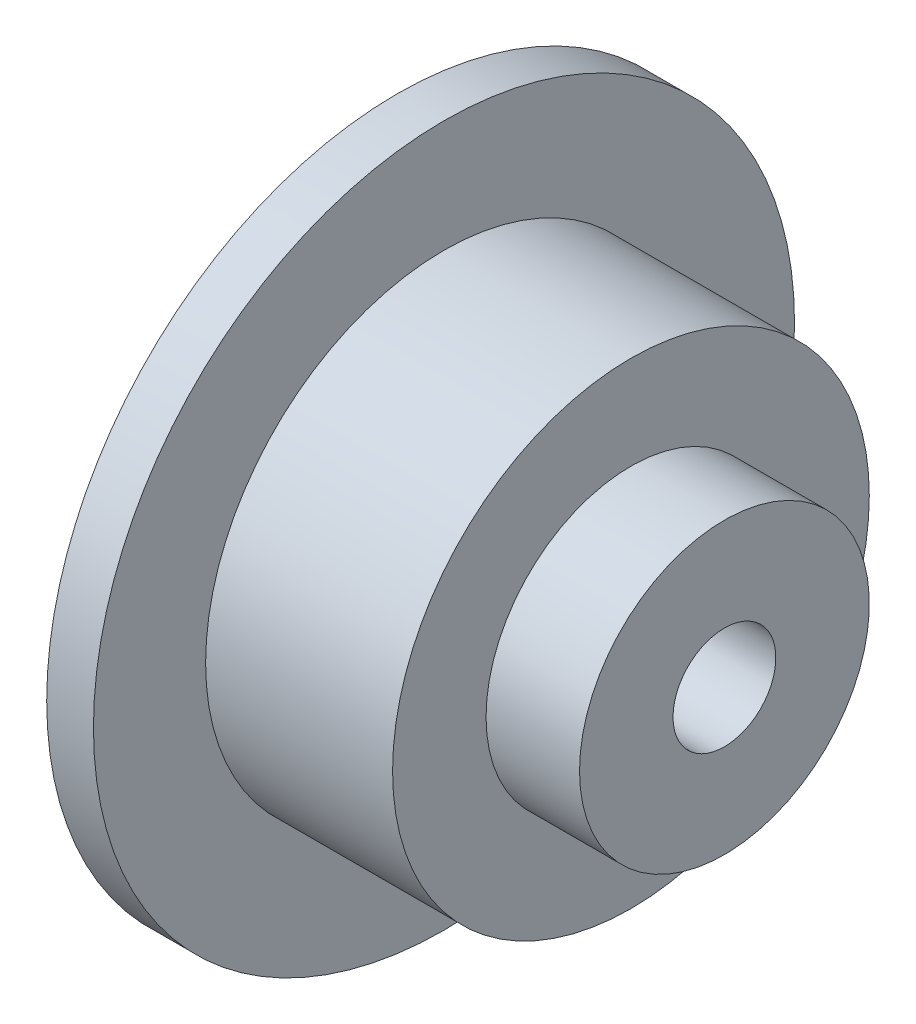
ISO-10303-21;
HEADER;
FILE_DESCRIPTION(('STEP AP214'),'2;1');
FILE_NAME('part.step','',(''),(''),'','','');
FILE_SCHEMA(('AUTOMOTIVE_DESIGN { 1 0 10303 214 1 1 1 1 }'));
ENDSEC;
DATA;
#1=APPLICATION_CONTEXT('core data for automotive mechanical design processes');
#2=APPLICATION_PROTOCOL_DEFINITION('international standard','automotive_design',2000,#1);
#3=PRODUCT_CONTEXT('',#1,'mechanical');
#4=PRODUCT('Part','Part','',(#3));
#5=PRODUCT_RELATED_PRODUCT_CATEGORY('part','',(#4));
#6=PRODUCT_DEFINITION_FORMATION('','',#4);
#7=PRODUCT_DEFINITION_CONTEXT('part definition',#1,'design');
#8=PRODUCT_DEFINITION('design','',#6,#7);
#9=PRODUCT_DEFINITION_SHAPE('','',#8);
#10=(LENGTH_UNIT() NAMED_UNIT(*) SI_UNIT(.MILLI.,.METRE.));
#11=(NAMED_UNIT(*) PLANE_ANGLE_UNIT() SI_UNIT($,.RADIAN.));
#12=(NAMED_UNIT(*) SI_UNIT($,.STERADIAN.) SOLID_ANGLE_UNIT());
#13=UNCERTAINTY_MEASURE_WITH_UNIT(LENGTH_MEASURE(1.E-05),#10,'distance_accuracy_value','');
#14=(GEOMETRIC_REPRESENTATION_CONTEXT(3) GLOBAL_UNCERTAINTY_ASSIGNED_CONTEXT((#13)) GLOBAL_UNIT_ASSIGNED_CONTEXT((#10,
#11,#12)) REPRESENTATION_CONTEXT('',''));
#15=CARTESIAN_POINT('',(0.,0.,0.));
#16=DIRECTION('',(0.,0.,1.));
#17=DIRECTION('',(1.,0.,0.));
#18=AXIS2_PLACEMENT_3D('',#15,#16,#17);
#19=CARTESIAN_POINT('',(0.,0.,0.));
#20=DIRECTION('',(-1.,0.,0.));
#21=DIRECTION('',(0.,0.,1.));
#22=AXIS2_PLACEMENT_3D('',#19,#20,#21);
#23=CYLINDRICAL_SURFACE('',#22,2.5);
#24=CARTESIAN_POINT('',(4.,0.,0.));
#25=DIRECTION('',(-1.,0.,0.));
#26=DIRECTION('',(0.,0.,1.));
#27=AXIS2_PLACEMENT_3D('',#24,#25,#26);
#28=CIRCLE('',#27,2.5);
#29=CARTESIAN_POINT('',(4.,0.,2.5));
#30=VERTEX_POINT('',#29);
#31=EDGE_CURVE('E80',#30,#30,#28,.T.);
#32=ORIENTED_EDGE('',*,*,#31,.F.);
#33=EDGE_LOOP('',(#32));
#34=FACE_BOUND('',#33,.T.);
#35=CARTESIAN_POINT('',(0.,0.,0.));
#36=DIRECTION('',(-1.,0.,0.));
#37=DIRECTION('',(0.,0.,1.));
#38=AXIS2_PLACEMENT_3D('',#35,#36,#37);
#39=CIRCLE('',#38,2.5);
#40=CARTESIAN_POINT('',(0.,0.,2.5));
#41=VERTEX_POINT('',#40);
#42=EDGE_CURVE('E10',#41,#41,#39,.T.);
#43=ORIENTED_EDGE('',*,*,#42,.T.);
#44=EDGE_LOOP('',(#43));
#45=FACE_BOUND('',#44,.T.);
#46=ADVANCED_FACE('F37',(#34,#45),#23,.F.);
#47=CARTESIAN_POINT('',(0.,0.,-2.5));
#48=DIRECTION('',(1.,0.,0.));
#49=DIRECTION('',(0.,0.,-1.));
#50=AXIS2_PLACEMENT_3D('',#47,#48,#49);
#51=PLANE('',#50);
#52=ORIENTED_EDGE('',*,*,#42,.F.);
#53=EDGE_LOOP('',(#52));
#54=FACE_BOUND('',#53,.T.);
#55=CARTESIAN_POINT('',(0.,0.,0.));
#56=DIRECTION('',(-1.,0.,0.));
#57=DIRECTION('',(0.,0.,1.));
#58=AXIS2_PLACEMENT_3D('',#55,#56,#57);
#59=CIRCLE('',#58,7.5);
#60=CARTESIAN_POINT('',(0.,0.,7.5));
#61=VERTEX_POINT('',#60);
#62=EDGE_CURVE('E44',#61,#61,#59,.T.);
#63=ORIENTED_EDGE('',*,*,#62,.T.);
#64=EDGE_LOOP('',(#63));
#65=FACE_BOUND('',#64,.T.);
#66=ADVANCED_FACE('F88',(#54,#65),#51,.F.);
#67=CARTESIAN_POINT('',(0.,0.,0.));
#68=DIRECTION('',(-1.,0.,0.));
#69=DIRECTION('',(0.,0.,1.));
#70=AXIS2_PLACEMENT_3D('',#67,#68,#69);
#71=CYLINDRICAL_SURFACE('',#70,7.5);
#72=ORIENTED_EDGE('',*,*,#62,.F.);
#73=EDGE_LOOP('',(#72));
#74=FACE_BOUND('',#73,.T.);
#75=CARTESIAN_POINT('',(1.,0.,0.));
#76=DIRECTION('',(-1.,0.,0.));
#77=DIRECTION('',(0.,0.,1.));
#78=AXIS2_PLACEMENT_3D('',#75,#76,#77);
#79=CIRCLE('',#78,7.5);
#80=CARTESIAN_POINT('',(1.,0.,7.5));
#81=VERTEX_POINT('',#80);
#82=EDGE_CURVE('E49',#81,#81,#79,.T.);
#83=ORIENTED_EDGE('',*,*,#82,.T.);
#84=EDGE_LOOP('',(#83));
#85=FACE_BOUND('',#84,.T.);
#86=ADVANCED_FACE('F92',(#74,#85),#71,.T.);
#87=CARTESIAN_POINT('',(1.,0.,-7.5));
#88=DIRECTION('',(-1.,0.,0.));
#89=DIRECTION('',(0.,0.,1.));
#90=AXIS2_PLACEMENT_3D('',#87,#88,#89);
#91=PLANE('',#90);
#92=ORIENTED_EDGE('',*,*,#82,.F.);
#93=EDGE_LOOP('',(#92));
#94=FACE_BOUND('',#93,.T.);
#95=CARTESIAN_POINT('',(1.,0.,0.));
#96=DIRECTION('',(-1.,0.,0.));
#97=DIRECTION('',(0.,0.,1.));
#98=AXIS2_PLACEMENT_3D('',#95,#96,#97);
#99=CIRCLE('',#98,5.1);
#100=CARTESIAN_POINT('',(1.,0.,5.1));
#101=VERTEX_POINT('',#100);
#102=EDGE_CURVE('E54',#101,#101,#99,.T.);
#103=ORIENTED_EDGE('',*,*,#102,.T.);
#104=EDGE_LOOP('',(#103));
#105=FACE_BOUND('',#104,.T.);
#106=ADVANCED_FACE('F97',(#94,#105),#91,.F.);
#107=CARTESIAN_POINT('',(0.,0.,0.));
#108=DIRECTION('',(-1.,0.,0.));
#109=DIRECTION('',(0.,0.,1.));
#110=AXIS2_PLACEMENT_3D('',#107,#108,#109);
#111=CYLINDRICAL_SURFACE('',#110,5.1);
#112=ORIENTED_EDGE('',*,*,#102,.F.);
#113=EDGE_LOOP('',(#112));
#114=FACE_BOUND('',#113,.T.);
#115=CARTESIAN_POINT('',(5.,0.,0.));
#116=DIRECTION('',(-1.,0.,0.));
#117=DIRECTION('',(0.,0.,1.));
#118=AXIS2_PLACEMENT_3D('',#115,#116,#117);
#119=CIRCLE('',#118,5.1);
#120=CARTESIAN_POINT('',(5.,0.,5.1));
#121=VERTEX_POINT('',#120);
#122=EDGE_CURVE('E60',#121,#121,#119,.T.);
#123=ORIENTED_EDGE('',*,*,#122,.T.);
#124=EDGE_LOOP('',(#123));
#125=FACE_BOUND('',#124,.T.);
#126=ADVANCED_FACE('F103',(#114,#125),#111,.T.);
#127=CARTESIAN_POINT('',(5.,0.,-5.1));
#128=DIRECTION('',(-1.,0.,0.));
#129=DIRECTION('',(0.,0.,1.));
#130=AXIS2_PLACEMENT_3D('',#127,#128,#129);
#131=PLANE('',#130);
#132=ORIENTED_EDGE('',*,*,#122,.F.);
#133=EDGE_LOOP('',(#132));
#134=FACE_BOUND('',#133,.T.);
#135=CARTESIAN_POINT('',(5.,0.,0.));
#136=DIRECTION('',(-1.,0.,0.));
#137=DIRECTION('',(0.,0.,1.));
#138=AXIS2_PLACEMENT_3D('',#135,#136,#137);
#139=CIRCLE('',#138,3.1);
#140=CARTESIAN_POINT('',(5.,0.,3.1));
#141=VERTEX_POINT('',#140);
#142=EDGE_CURVE('E64',#141,#141,#139,.T.);
#143=ORIENTED_EDGE('',*,*,#142,.T.);
#144=EDGE_LOOP('',(#143));
#145=FACE_BOUND('',#144,.T.);
#146=ADVANCED_FACE('F107',(#134,#145),#131,.F.);
#147=CARTESIAN_POINT('',(0.,0.,0.));
#148=DIRECTION('',(-1.,0.,0.));
#149=DIRECTION('',(0.,0.,1.));
#150=AXIS2_PLACEMENT_3D('',#147,#148,#149);
#151=CYLINDRICAL_SURFACE('',#150,3.1);
#152=ORIENTED_EDGE('',*,*,#142,.F.);
#153=EDGE_LOOP('',(#152));
#154=FACE_BOUND('',#153,.T.);
#155=CARTESIAN_POINT('',(7.,0.,0.));
#156=DIRECTION('',(-1.,0.,0.));
#157=DIRECTION('',(0.,0.,1.));
#158=AXIS2_PLACEMENT_3D('',#155,#156,#157);
#159=CIRCLE('',#158,3.1);
#160=CARTESIAN_POINT('',(7.,0.,3.1));
#161=VERTEX_POINT('',#160);
#162=EDGE_CURVE('E68',#161,#161,#159,.T.);
#163=ORIENTED_EDGE('',*,*,#162,.T.);
#164=EDGE_LOOP('',(#163));
#165=FACE_BOUND('',#164,.T.);
#166=ADVANCED_FACE('F111',(#154,#165),#151,.T.);
#167=CARTESIAN_POINT('',(7.,0.,-1.1));
#168=DIRECTION('',(-1.,0.,0.));
#169=DIRECTION('',(0.,0.,1.));
#170=AXIS2_PLACEMENT_3D('',#167,#168,#169);
#171=PLANE('',#170);
#172=ORIENTED_EDGE('',*,*,#162,.F.);
#173=EDGE_LOOP('',(#172));
#174=FACE_BOUND('',#173,.T.);
#175=CARTESIAN_POINT('',(7.,0.,0.));
#176=DIRECTION('',(-1.,0.,0.));
#177=DIRECTION('',(0.,0.,1.));
#178=AXIS2_PLACEMENT_3D('',#175,#176,#177);
#179=CIRCLE('',#178,1.1);
#180=CARTESIAN_POINT('',(7.,0.,1.1));
#181=VERTEX_POINT('',#180);
#182=EDGE_CURVE('E72',#181,#181,#179,.T.);
#183=ORIENTED_EDGE('',*,*,#182,.T.);
#184=EDGE_LOOP('',(#183));
#185=FACE_BOUND('',#184,.T.);
#186=ADVANCED_FACE('F115',(#174,#185),#171,.F.);
#187=CARTESIAN_POINT('',(0.,0.,0.));
#188=DIRECTION('',(-1.,0.,0.));
#189=DIRECTION('',(0.,0.,1.));
#190=AXIS2_PLACEMENT_3D('',#187,#188,#189);
#191=CYLINDRICAL_SURFACE('',#190,1.1);
#192=ORIENTED_EDGE('',*,*,#182,.F.);
#193=EDGE_LOOP('',(#192));
#194=FACE_BOUND('',#193,.T.);
#195=CARTESIAN_POINT('',(4.,0.,0.));
#196=DIRECTION('',(-1.,0.,0.));
#197=DIRECTION('',(0.,0.,1.));
#198=AXIS2_PLACEMENT_3D('',#195,#196,#197);
#199=CIRCLE('',#198,1.1);
#200=CARTESIAN_POINT('',(4.,0.,1.1));
#201=VERTEX_POINT('',#200);
#202=EDGE_CURVE('E76',#201,#201,#199,.T.);
#203=ORIENTED_EDGE('',*,*,#202,.T.);
#204=EDGE_LOOP('',(#203));
#205=FACE_BOUND('',#204,.T.);
#206=ADVANCED_FACE('F119',(#194,#205),#191,.F.);
#207=CARTESIAN_POINT('',(4.,0.,-1.1));
#208=DIRECTION('',(1.,0.,0.));
#209=DIRECTION('',(0.,0.,-1.));
#210=AXIS2_PLACEMENT_3D('',#207,#208,#209);
#211=PLANE('',#210);
#212=ORIENTED_EDGE('',*,*,#202,.F.);
#213=EDGE_LOOP('',(#212));
#214=FACE_BOUND('',#213,.T.);
#215=ORIENTED_EDGE('',*,*,#31,.T.);
#216=EDGE_LOOP('',(#215));
#217=FACE_BOUND('',#216,.T.);
#218=ADVANCED_FACE('F85',(#214,#217),#211,.F.);
#219=CLOSED_SHELL('',(#46,#66,#86,#106,#126,#146,#166,#186,#206,#218));
#220=MANIFOLD_SOLID_BREP('B2',#219);
#221=ADVANCED_BREP_SHAPE_REPRESENTATION('',(#18,#220),#14);
#222=SHAPE_DEFINITION_REPRESENTATION(#9,#221);
ENDSEC;
END-ISO-10303-21;
